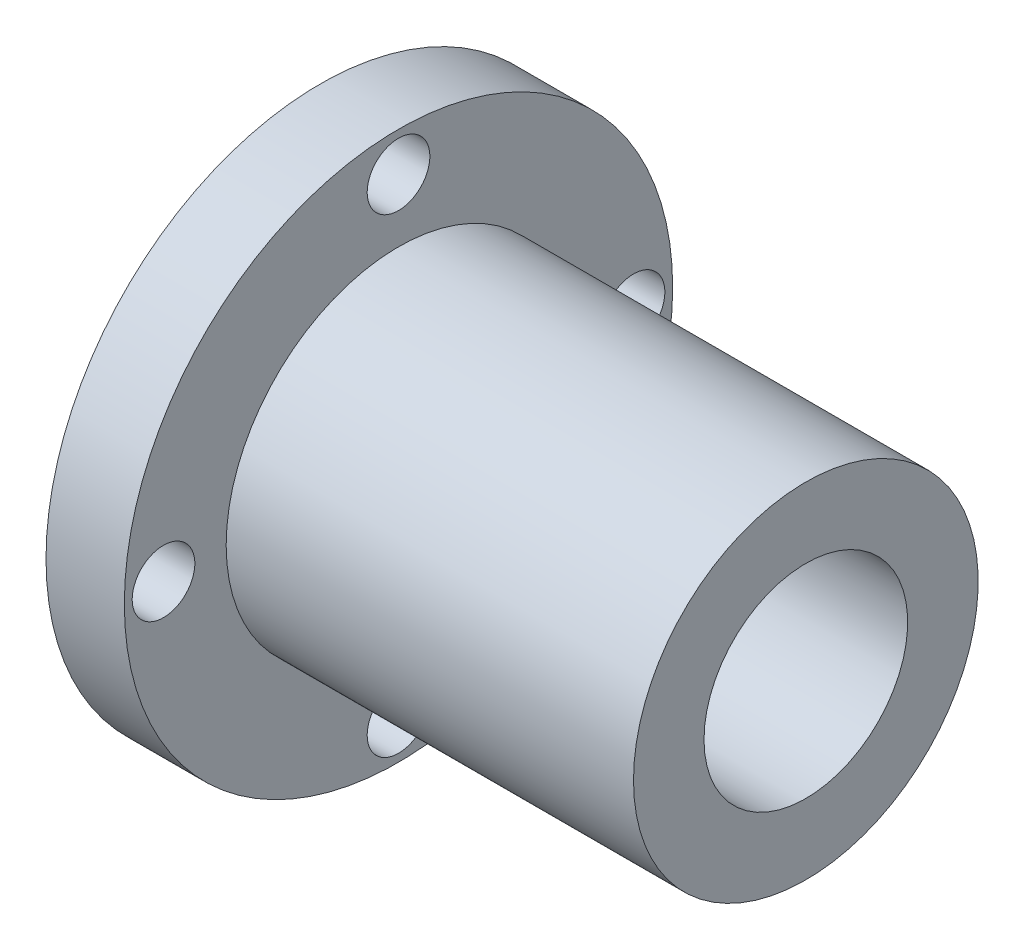
ISO-10303-21;
HEADER;
FILE_DESCRIPTION(('STEP AP214'),'2;1');
FILE_NAME('part.step','',(''),(''),'','','');
FILE_SCHEMA(('AUTOMOTIVE_DESIGN { 1 0 10303 214 1 1 1 1 }'));
ENDSEC;
DATA;
#1=APPLICATION_CONTEXT('core data for automotive mechanical design processes');
#2=APPLICATION_PROTOCOL_DEFINITION('international standard','automotive_design',2000,#1);
#3=PRODUCT_CONTEXT('',#1,'mechanical');
#4=PRODUCT('Part','Part','',(#3));
#5=PRODUCT_RELATED_PRODUCT_CATEGORY('part','',(#4));
#6=PRODUCT_DEFINITION_FORMATION('','',#4);
#7=PRODUCT_DEFINITION_CONTEXT('part definition',#1,'design');
#8=PRODUCT_DEFINITION('design','',#6,#7);
#9=PRODUCT_DEFINITION_SHAPE('','',#8);
#10=(LENGTH_UNIT() NAMED_UNIT(*) SI_UNIT(.MILLI.,.METRE.));
#11=(NAMED_UNIT(*) PLANE_ANGLE_UNIT() SI_UNIT($,.RADIAN.));
#12=(NAMED_UNIT(*) SI_UNIT($,.STERADIAN.) SOLID_ANGLE_UNIT());
#13=UNCERTAINTY_MEASURE_WITH_UNIT(LENGTH_MEASURE(1.E-05),#10,'distance_accuracy_value','');
#14=(GEOMETRIC_REPRESENTATION_CONTEXT(3) GLOBAL_UNCERTAINTY_ASSIGNED_CONTEXT((#13)) GLOBAL_UNIT_ASSIGNED_CONTEXT((#10,
#11,#12)) REPRESENTATION_CONTEXT('',''));
#15=CARTESIAN_POINT('',(0.,0.,0.));
#16=DIRECTION('',(0.,0.,1.));
#17=DIRECTION('',(1.,0.,0.));
#18=AXIS2_PLACEMENT_3D('',#15,#16,#17);
#19=CARTESIAN_POINT('',(0.,0.,0.));
#20=DIRECTION('',(-1.,0.,0.));
#21=DIRECTION('',(0.,0.,1.));
#22=AXIS2_PLACEMENT_3D('',#19,#20,#21);
#23=CYLINDRICAL_SURFACE('',#22,6.5);
#24=CARTESIAN_POINT('',(31.,0.,0.));
#25=DIRECTION('',(-1.,0.,0.));
#26=DIRECTION('',(0.,0.,1.));
#27=AXIS2_PLACEMENT_3D('',#24,#25,#26);
#28=CIRCLE('',#27,6.5);
#29=CARTESIAN_POINT('',(31.,0.,6.5));
#30=VERTEX_POINT('',#29);
#31=EDGE_CURVE('E10',#30,#30,#28,.T.);
#32=ORIENTED_EDGE('',*,*,#31,.F.);
#33=EDGE_LOOP('',(#32));
#34=FACE_BOUND('',#33,.T.);
#35=CARTESIAN_POINT('',(20.,0.,0.));
#36=DIRECTION('',(-1.,0.,0.));
#37=DIRECTION('',(0.,0.,1.));
#38=AXIS2_PLACEMENT_3D('',#35,#36,#37);
#39=CIRCLE('',#38,6.5);
#40=CARTESIAN_POINT('',(20.,0.,6.5));
#41=VERTEX_POINT('',#40);
#42=EDGE_CURVE('E57',#41,#41,#39,.T.);
#43=ORIENTED_EDGE('',*,*,#42,.T.);
#44=EDGE_LOOP('',(#43));
#45=FACE_BOUND('',#44,.T.);
#46=ADVANCED_FACE('F29',(#34,#45),#23,.F.);
#47=CARTESIAN_POINT('',(31.,6.5,0.));
#48=DIRECTION('',(-1.,0.,0.));
#49=DIRECTION('',(0.,0.,1.));
#50=AXIS2_PLACEMENT_3D('',#47,#48,#49);
#51=PLANE('',#50);
#52=CARTESIAN_POINT('',(31.,0.,0.));
#53=DIRECTION('',(-1.,0.,0.));
#54=DIRECTION('',(0.,0.,1.));
#55=AXIS2_PLACEMENT_3D('',#52,#53,#54);
#56=CIRCLE('',#55,11.);
#57=CARTESIAN_POINT('',(31.,0.,11.));
#58=VERTEX_POINT('',#57);
#59=EDGE_CURVE('E35',#58,#58,#56,.T.);
#60=ORIENTED_EDGE('',*,*,#59,.F.);
#61=EDGE_LOOP('',(#60));
#62=FACE_BOUND('',#61,.T.);
#63=ORIENTED_EDGE('',*,*,#31,.T.);
#64=EDGE_LOOP('',(#63));
#65=FACE_BOUND('',#64,.T.);
#66=ADVANCED_FACE('F118',(#62,#65),#51,.F.);
#67=CARTESIAN_POINT('',(0.,0.,0.));
#68=DIRECTION('',(-1.,0.,0.));
#69=DIRECTION('',(0.,0.,1.));
#70=AXIS2_PLACEMENT_3D('',#67,#68,#69);
#71=CYLINDRICAL_SURFACE('',#70,11.);
#72=CARTESIAN_POINT('',(5.,0.,0.));
#73=DIRECTION('',(-1.,0.,0.));
#74=DIRECTION('',(0.,0.,1.));
#75=AXIS2_PLACEMENT_3D('',#72,#73,#74);
#76=CIRCLE('',#75,11.);
#77=CARTESIAN_POINT('',(5.,0.,11.));
#78=VERTEX_POINT('',#77);
#79=EDGE_CURVE('E39',#78,#78,#76,.T.);
#80=ORIENTED_EDGE('',*,*,#79,.F.);
#81=EDGE_LOOP('',(#80));
#82=FACE_BOUND('',#81,.T.);
#83=ORIENTED_EDGE('',*,*,#59,.T.);
#84=EDGE_LOOP('',(#83));
#85=FACE_BOUND('',#84,.T.);
#86=ADVANCED_FACE('F112',(#82,#85),#71,.T.);
#87=CARTESIAN_POINT('',(5.,17.5,0.));
#88=DIRECTION('',(-1.,0.,0.));
#89=DIRECTION('',(0.,0.,1.));
#90=AXIS2_PLACEMENT_3D('',#87,#88,#89);
#91=PLANE('',#90);
#92=CARTESIAN_POINT('',(5.,0.,-15.));
#93=DIRECTION('',(-1.,0.,0.));
#94=DIRECTION('',(0.,0.,1.));
#95=AXIS2_PLACEMENT_3D('',#92,#93,#94);
#96=CIRCLE('',#95,2.);
#97=CARTESIAN_POINT('',(5.,0.,-13.));
#98=VERTEX_POINT('',#97);
#99=EDGE_CURVE('E78',#98,#98,#96,.T.);
#100=ORIENTED_EDGE('',*,*,#99,.T.);
#101=EDGE_LOOP('',(#100));
#102=FACE_BOUND('',#101,.T.);
#103=CARTESIAN_POINT('',(5.,-15.,0.));
#104=DIRECTION('',(-1.,0.,0.));
#105=DIRECTION('',(0.,0.,1.));
#106=AXIS2_PLACEMENT_3D('',#103,#104,#105);
#107=CIRCLE('',#106,2.);
#108=CARTESIAN_POINT('',(5.,-15.,2.));
#109=VERTEX_POINT('',#108);
#110=EDGE_CURVE('E72',#109,#109,#107,.T.);
#111=ORIENTED_EDGE('',*,*,#110,.T.);
#112=EDGE_LOOP('',(#111));
#113=FACE_BOUND('',#112,.T.);
#114=CARTESIAN_POINT('',(5.,0.,15.));
#115=DIRECTION('',(-1.,0.,0.));
#116=DIRECTION('',(0.,0.,1.));
#117=AXIS2_PLACEMENT_3D('',#114,#115,#116);
#118=CIRCLE('',#117,2.);
#119=CARTESIAN_POINT('',(5.,0.,17.));
#120=VERTEX_POINT('',#119);
#121=EDGE_CURVE('E66',#120,#120,#118,.T.);
#122=ORIENTED_EDGE('',*,*,#121,.T.);
#123=EDGE_LOOP('',(#122));
#124=FACE_BOUND('',#123,.T.);
#125=CARTESIAN_POINT('',(5.,15.,0.));
#126=DIRECTION('',(-1.,0.,0.));
#127=DIRECTION('',(0.,0.,1.));
#128=AXIS2_PLACEMENT_3D('',#125,#126,#127);
#129=CIRCLE('',#128,2.);
#130=CARTESIAN_POINT('',(5.,15.,2.));
#131=VERTEX_POINT('',#130);
#132=EDGE_CURVE('E60',#131,#131,#129,.T.);
#133=ORIENTED_EDGE('',*,*,#132,.T.);
#134=EDGE_LOOP('',(#133));
#135=FACE_BOUND('',#134,.T.);
#136=CARTESIAN_POINT('',(5.,0.,0.));
#137=DIRECTION('',(-1.,0.,0.));
#138=DIRECTION('',(0.,0.,1.));
#139=AXIS2_PLACEMENT_3D('',#136,#137,#138);
#140=CIRCLE('',#139,17.5);
#141=CARTESIAN_POINT('',(5.,0.,17.5));
#142=VERTEX_POINT('',#141);
#143=EDGE_CURVE('E43',#142,#142,#140,.T.);
#144=ORIENTED_EDGE('',*,*,#143,.F.);
#145=EDGE_LOOP('',(#144));
#146=FACE_BOUND('',#145,.T.);
#147=ORIENTED_EDGE('',*,*,#79,.T.);
#148=EDGE_LOOP('',(#147));
#149=FACE_BOUND('',#148,.T.);
#150=ADVANCED_FACE('F106',(#102,#113,#124,#135,#146,#149),#91,.F.);
#151=CARTESIAN_POINT('',(0.,0.,0.));
#152=DIRECTION('',(-1.,0.,0.));
#153=DIRECTION('',(0.,0.,1.));
#154=AXIS2_PLACEMENT_3D('',#151,#152,#153);
#155=CYLINDRICAL_SURFACE('',#154,17.5);
#156=CARTESIAN_POINT('',(0.,0.,0.));
#157=DIRECTION('',(-1.,0.,0.));
#158=DIRECTION('',(0.,0.,1.));
#159=AXIS2_PLACEMENT_3D('',#156,#157,#158);
#160=CIRCLE('',#159,17.5);
#161=CARTESIAN_POINT('',(0.,0.,17.5));
#162=VERTEX_POINT('',#161);
#163=EDGE_CURVE('E48',#162,#162,#160,.T.);
#164=ORIENTED_EDGE('',*,*,#163,.F.);
#165=EDGE_LOOP('',(#164));
#166=FACE_BOUND('',#165,.T.);
#167=ORIENTED_EDGE('',*,*,#143,.T.);
#168=EDGE_LOOP('',(#167));
#169=FACE_BOUND('',#168,.T.);
#170=ADVANCED_FACE('F92',(#166,#169),#155,.T.);
#171=CARTESIAN_POINT('',(0.,10.,0.));
#172=DIRECTION('',(1.,0.,0.));
#173=DIRECTION('',(0.,0.,-1.));
#174=AXIS2_PLACEMENT_3D('',#171,#172,#173);
#175=PLANE('',#174);
#176=CARTESIAN_POINT('',(0.,0.,-15.));
#177=DIRECTION('',(-1.,0.,0.));
#178=DIRECTION('',(0.,0.,1.));
#179=AXIS2_PLACEMENT_3D('',#176,#177,#178);
#180=CIRCLE('',#179,2.);
#181=CARTESIAN_POINT('',(0.,0.,-13.));
#182=VERTEX_POINT('',#181);
#183=EDGE_CURVE('E81',#182,#182,#180,.T.);
#184=ORIENTED_EDGE('',*,*,#183,.F.);
#185=EDGE_LOOP('',(#184));
#186=FACE_BOUND('',#185,.T.);
#187=CARTESIAN_POINT('',(0.,-15.,0.));
#188=DIRECTION('',(-1.,0.,0.));
#189=DIRECTION('',(0.,0.,1.));
#190=AXIS2_PLACEMENT_3D('',#187,#188,#189);
#191=CIRCLE('',#190,2.);
#192=CARTESIAN_POINT('',(0.,-15.,2.));
#193=VERTEX_POINT('',#192);
#194=EDGE_CURVE('E75',#193,#193,#191,.T.);
#195=ORIENTED_EDGE('',*,*,#194,.F.);
#196=EDGE_LOOP('',(#195));
#197=FACE_BOUND('',#196,.T.);
#198=CARTESIAN_POINT('',(0.,0.,15.));
#199=DIRECTION('',(-1.,0.,0.));
#200=DIRECTION('',(0.,0.,1.));
#201=AXIS2_PLACEMENT_3D('',#198,#199,#200);
#202=CIRCLE('',#201,2.);
#203=CARTESIAN_POINT('',(0.,0.,17.));
#204=VERTEX_POINT('',#203);
#205=EDGE_CURVE('E69',#204,#204,#202,.T.);
#206=ORIENTED_EDGE('',*,*,#205,.F.);
#207=EDGE_LOOP('',(#206));
#208=FACE_BOUND('',#207,.T.);
#209=CARTESIAN_POINT('',(0.,15.,0.));
#210=DIRECTION('',(-1.,0.,0.));
#211=DIRECTION('',(0.,0.,1.));
#212=AXIS2_PLACEMENT_3D('',#209,#210,#211);
#213=CIRCLE('',#212,2.);
#214=CARTESIAN_POINT('',(0.,15.,2.));
#215=VERTEX_POINT('',#214);
#216=EDGE_CURVE('E63',#215,#215,#213,.T.);
#217=ORIENTED_EDGE('',*,*,#216,.F.);
#218=EDGE_LOOP('',(#217));
#219=FACE_BOUND('',#218,.T.);
#220=CARTESIAN_POINT('',(0.,0.,0.));
#221=DIRECTION('',(-1.,0.,0.));
#222=DIRECTION('',(0.,0.,1.));
#223=AXIS2_PLACEMENT_3D('',#220,#221,#222);
#224=CIRCLE('',#223,10.);
#225=CARTESIAN_POINT('',(0.,0.,10.));
#226=VERTEX_POINT('',#225);
#227=EDGE_CURVE('E51',#226,#226,#224,.T.);
#228=ORIENTED_EDGE('',*,*,#227,.F.);
#229=EDGE_LOOP('',(#228));
#230=FACE_BOUND('',#229,.T.);
#231=ORIENTED_EDGE('',*,*,#163,.T.);
#232=EDGE_LOOP('',(#231));
#233=FACE_BOUND('',#232,.T.);
#234=ADVANCED_FACE('F88',(#186,#197,#208,#219,#230,#233),#175,.F.);
#235=CARTESIAN_POINT('',(0.,0.,0.));
#236=DIRECTION('',(-1.,0.,0.));
#237=DIRECTION('',(0.,0.,1.));
#238=AXIS2_PLACEMENT_3D('',#235,#236,#237);
#239=CYLINDRICAL_SURFACE('',#238,10.);
#240=CARTESIAN_POINT('',(20.,0.,0.));
#241=DIRECTION('',(-1.,0.,0.));
#242=DIRECTION('',(0.,0.,1.));
#243=AXIS2_PLACEMENT_3D('',#240,#241,#242);
#244=CIRCLE('',#243,10.);
#245=CARTESIAN_POINT('',(20.,0.,10.));
#246=VERTEX_POINT('',#245);
#247=EDGE_CURVE('E54',#246,#246,#244,.T.);
#248=ORIENTED_EDGE('',*,*,#247,.F.);
#249=EDGE_LOOP('',(#248));
#250=FACE_BOUND('',#249,.T.);
#251=ORIENTED_EDGE('',*,*,#227,.T.);
#252=EDGE_LOOP('',(#251));
#253=FACE_BOUND('',#252,.T.);
#254=ADVANCED_FACE('F91',(#250,#253),#239,.F.);
#255=CARTESIAN_POINT('',(20.,6.5,0.));
#256=DIRECTION('',(1.,0.,0.));
#257=DIRECTION('',(0.,0.,-1.));
#258=AXIS2_PLACEMENT_3D('',#255,#256,#257);
#259=PLANE('',#258);
#260=ORIENTED_EDGE('',*,*,#42,.F.);
#261=EDGE_LOOP('',(#260));
#262=FACE_BOUND('',#261,.T.);
#263=ORIENTED_EDGE('',*,*,#247,.T.);
#264=EDGE_LOOP('',(#263));
#265=FACE_BOUND('',#264,.T.);
#266=ADVANCED_FACE('F131',(#262,#265),#259,.F.);
#267=CARTESIAN_POINT('',(31.,15.,0.));
#268=DIRECTION('',(-1.,0.,0.));
#269=DIRECTION('',(0.,0.,1.));
#270=AXIS2_PLACEMENT_3D('',#267,#268,#269);
#271=CYLINDRICAL_SURFACE('',#270,2.);
#272=ORIENTED_EDGE('',*,*,#216,.T.);
#273=EDGE_LOOP('',(#272));
#274=FACE_BOUND('',#273,.T.);
#275=ORIENTED_EDGE('',*,*,#132,.F.);
#276=EDGE_LOOP('',(#275));
#277=FACE_BOUND('',#276,.T.);
#278=ADVANCED_FACE('F134',(#274,#277),#271,.F.);
#279=CARTESIAN_POINT('',(31.,0.,15.));
#280=DIRECTION('',(-1.,0.,0.));
#281=DIRECTION('',(0.,0.,1.));
#282=AXIS2_PLACEMENT_3D('',#279,#280,#281);
#283=CYLINDRICAL_SURFACE('',#282,2.);
#284=ORIENTED_EDGE('',*,*,#205,.T.);
#285=EDGE_LOOP('',(#284));
#286=FACE_BOUND('',#285,.T.);
#287=ORIENTED_EDGE('',*,*,#121,.F.);
#288=EDGE_LOOP('',(#287));
#289=FACE_BOUND('',#288,.T.);
#290=ADVANCED_FACE('F146',(#286,#289),#283,.F.);
#291=CARTESIAN_POINT('',(31.,-15.,0.));
#292=DIRECTION('',(-1.,0.,0.));
#293=DIRECTION('',(0.,0.,1.));
#294=AXIS2_PLACEMENT_3D('',#291,#292,#293);
#295=CYLINDRICAL_SURFACE('',#294,2.);
#296=ORIENTED_EDGE('',*,*,#194,.T.);
#297=EDGE_LOOP('',(#296));
#298=FACE_BOUND('',#297,.T.);
#299=ORIENTED_EDGE('',*,*,#110,.F.);
#300=EDGE_LOOP('',(#299));
#301=FACE_BOUND('',#300,.T.);
#302=ADVANCED_FACE('F150',(#298,#301),#295,.F.);
#303=CARTESIAN_POINT('',(31.,0.,-15.));
#304=DIRECTION('',(-1.,0.,0.));
#305=DIRECTION('',(0.,0.,1.));
#306=AXIS2_PLACEMENT_3D('',#303,#304,#305);
#307=CYLINDRICAL_SURFACE('',#306,2.);
#308=ORIENTED_EDGE('',*,*,#183,.T.);
#309=EDGE_LOOP('',(#308));
#310=FACE_BOUND('',#309,.T.);
#311=ORIENTED_EDGE('',*,*,#99,.F.);
#312=EDGE_LOOP('',(#311));
#313=FACE_BOUND('',#312,.T.);
#314=ADVANCED_FACE('F85',(#310,#313),#307,.F.);
#315=CLOSED_SHELL('',(#46,#66,#86,#150,#170,#234,#254,#266,#278,#290,#302,#314));
#316=MANIFOLD_SOLID_BREP('B2',#315);
#317=ADVANCED_BREP_SHAPE_REPRESENTATION('',(#18,#316),#14);
#318=SHAPE_DEFINITION_REPRESENTATION(#9,#317);
ENDSEC;
END-ISO-10303-21;
